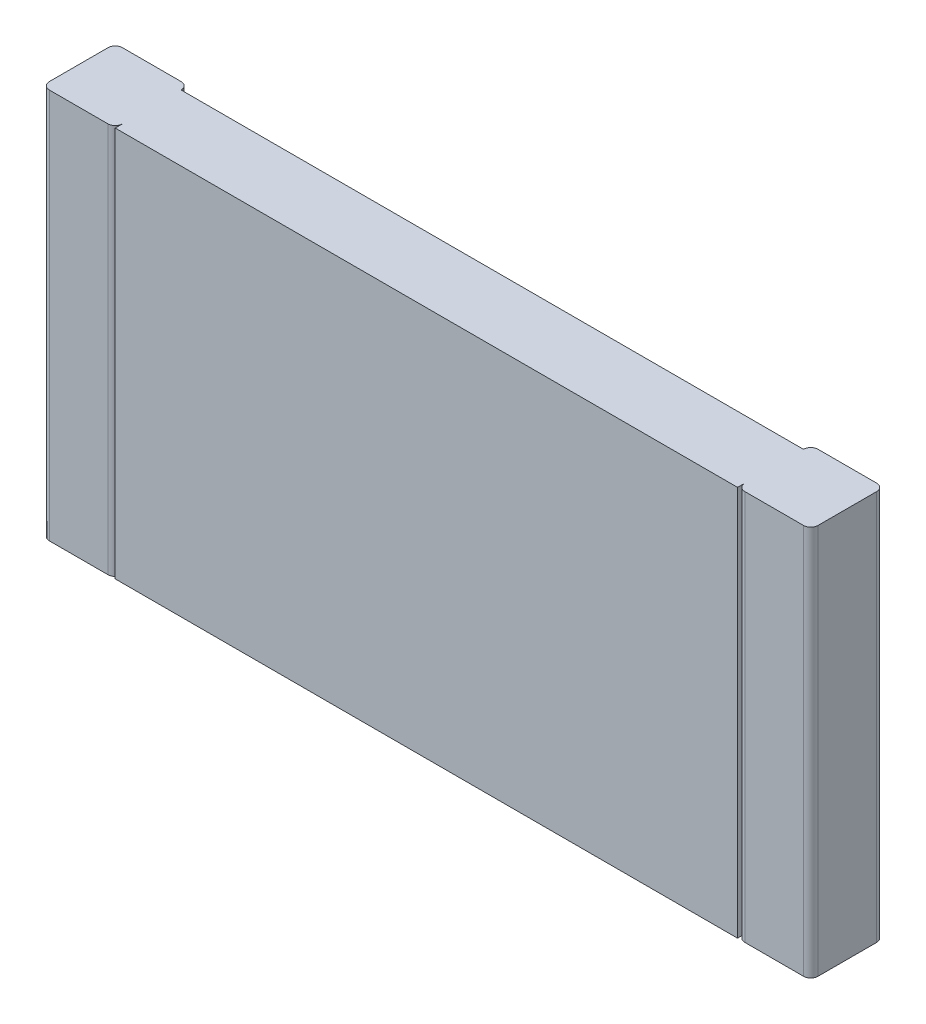
ISO-10303-21;
HEADER;
FILE_DESCRIPTION(('STEP AP214'),'2;1');
FILE_NAME('part.step','',(''),(''),'','','');
FILE_SCHEMA(('AUTOMOTIVE_DESIGN { 1 0 10303 214 1 1 1 1 }'));
ENDSEC;
DATA;
#1=APPLICATION_CONTEXT('core data for automotive mechanical design processes');
#2=APPLICATION_PROTOCOL_DEFINITION('international standard','automotive_design',2000,#1);
#3=PRODUCT_CONTEXT('',#1,'mechanical');
#4=PRODUCT('Part','Part','',(#3));
#5=PRODUCT_RELATED_PRODUCT_CATEGORY('part','',(#4));
#6=PRODUCT_DEFINITION_FORMATION('','',#4);
#7=PRODUCT_DEFINITION_CONTEXT('part definition',#1,'design');
#8=PRODUCT_DEFINITION('design','',#6,#7);
#9=PRODUCT_DEFINITION_SHAPE('','',#8);
#10=(LENGTH_UNIT() NAMED_UNIT(*) SI_UNIT(.MILLI.,.METRE.));
#11=(NAMED_UNIT(*) PLANE_ANGLE_UNIT() SI_UNIT($,.RADIAN.));
#12=(NAMED_UNIT(*) SI_UNIT($,.STERADIAN.) SOLID_ANGLE_UNIT());
#13=UNCERTAINTY_MEASURE_WITH_UNIT(LENGTH_MEASURE(1.E-05),#10,'distance_accuracy_value','');
#14=(GEOMETRIC_REPRESENTATION_CONTEXT(3) GLOBAL_UNCERTAINTY_ASSIGNED_CONTEXT((#13)) GLOBAL_UNIT_ASSIGNED_CONTEXT((#10,
#11,#12)) REPRESENTATION_CONTEXT('',''));
#15=CARTESIAN_POINT('',(0.,0.,0.));
#16=DIRECTION('',(0.,0.,1.));
#17=DIRECTION('',(1.,0.,0.));
#18=AXIS2_PLACEMENT_3D('',#15,#16,#17);
#19=CARTESIAN_POINT('',(-3.09,-1.6,0.06));
#20=DIRECTION('',(0.,1.,0.));
#21=DIRECTION('',(0.,0.,1.));
#22=AXIS2_PLACEMENT_3D('',#19,#20,#21);
#23=CYLINDRICAL_SURFACE('',#22,0.06);
#24=DIRECTION('',(0.,1.,0.));
#25=VECTOR('',#24,1.);
#26=CARTESIAN_POINT('',(-3.09,-1.6,0.));
#27=LINE('',#26,#25);
#28=CARTESIAN_POINT('',(-3.09,1.6,0.));
#29=VERTEX_POINT('',#28);
#30=CARTESIAN_POINT('',(-3.09,-1.6,0.));
#31=VERTEX_POINT('',#30);
#32=EDGE_CURVE('E177',#29,#31,#27,.F.);
#33=ORIENTED_EDGE('',*,*,#32,.T.);
#34=CARTESIAN_POINT('',(-3.09,-1.6,0.06));
#35=DIRECTION('',(0.,1.,0.));
#36=DIRECTION('',(0.,0.,1.));
#37=AXIS2_PLACEMENT_3D('',#34,#35,#36);
#38=CIRCLE('',#37,0.06);
#39=CARTESIAN_POINT('',(-3.15,-1.6,0.06));
#40=VERTEX_POINT('',#39);
#41=EDGE_CURVE('E150',#31,#40,#38,.T.);
#42=ORIENTED_EDGE('',*,*,#41,.T.);
#43=DIRECTION('',(0.,1.,0.));
#44=VECTOR('',#43,1.);
#45=CARTESIAN_POINT('',(-3.15,-1.6,0.06));
#46=LINE('',#45,#44);
#47=CARTESIAN_POINT('',(-3.15,1.6,0.06));
#48=VERTEX_POINT('',#47);
#49=EDGE_CURVE('E153',#40,#48,#46,.T.);
#50=ORIENTED_EDGE('',*,*,#49,.T.);
#51=CARTESIAN_POINT('',(-3.09,1.6,0.06));
#52=DIRECTION('',(0.,1.,0.));
#53=DIRECTION('',(0.,0.,1.));
#54=AXIS2_PLACEMENT_3D('',#51,#52,#53);
#55=CIRCLE('',#54,0.06);
#56=EDGE_CURVE('E20',#48,#29,#55,.F.);
#57=ORIENTED_EDGE('',*,*,#56,.T.);
#58=EDGE_LOOP('',(#33,#42,#50,#57));
#59=FACE_BOUND('',#58,.T.);
#60=ADVANCED_FACE('F17',(#59),#23,.T.);
#61=CARTESIAN_POINT('',(3.09,-1.6,0.06));
#62=DIRECTION('',(0.,1.,0.));
#63=DIRECTION('',(0.,0.,1.));
#64=AXIS2_PLACEMENT_3D('',#61,#62,#63);
#65=CYLINDRICAL_SURFACE('',#64,0.06);
#66=CARTESIAN_POINT('',(3.09,1.6,0.06));
#67=DIRECTION('',(0.,1.,0.));
#68=DIRECTION('',(0.,0.,1.));
#69=AXIS2_PLACEMENT_3D('',#66,#67,#68);
#70=CIRCLE('',#69,0.06);
#71=CARTESIAN_POINT('',(3.09,1.6,0.));
#72=VERTEX_POINT('',#71);
#73=CARTESIAN_POINT('',(3.15,1.6,0.06));
#74=VERTEX_POINT('',#73);
#75=EDGE_CURVE('E171',#72,#74,#70,.F.);
#76=ORIENTED_EDGE('',*,*,#75,.T.);
#77=DIRECTION('',(0.,1.,0.));
#78=VECTOR('',#77,1.);
#79=CARTESIAN_POINT('',(3.15,-1.6,0.06));
#80=LINE('',#79,#78);
#81=CARTESIAN_POINT('',(3.15,-1.6,0.06));
#82=VERTEX_POINT('',#81);
#83=EDGE_CURVE('E165',#82,#74,#80,.T.);
#84=ORIENTED_EDGE('',*,*,#83,.F.);
#85=CARTESIAN_POINT('',(3.09,-1.6,0.06));
#86=DIRECTION('',(0.,1.,0.));
#87=DIRECTION('',(0.,0.,1.));
#88=AXIS2_PLACEMENT_3D('',#85,#86,#87);
#89=CIRCLE('',#88,0.06);
#90=CARTESIAN_POINT('',(3.09,-1.6,0.));
#91=VERTEX_POINT('',#90);
#92=EDGE_CURVE('E223',#82,#91,#89,.T.);
#93=ORIENTED_EDGE('',*,*,#92,.T.);
#94=DIRECTION('',(0.,1.,0.));
#95=VECTOR('',#94,1.);
#96=CARTESIAN_POINT('',(3.09,-1.6,0.));
#97=LINE('',#96,#95);
#98=EDGE_CURVE('E172',#91,#72,#97,.T.);
#99=ORIENTED_EDGE('',*,*,#98,.T.);
#100=EDGE_LOOP('',(#76,#84,#93,#99));
#101=FACE_BOUND('',#100,.T.);
#102=ADVANCED_FACE('F228',(#101),#65,.T.);
#103=CARTESIAN_POINT('',(-3.15,-1.6,0.));
#104=DIRECTION('',(1.,0.,0.));
#105=DIRECTION('',(0.,0.,-1.));
#106=AXIS2_PLACEMENT_3D('',#103,#104,#105);
#107=PLANE('',#106);
#108=DIRECTION('',(0.,0.,-1.));
#109=VECTOR('',#108,1.);
#110=CARTESIAN_POINT('',(-3.15,1.6,0.));
#111=LINE('',#110,#109);
#112=CARTESIAN_POINT('',(-3.15,1.6,0.54));
#113=VERTEX_POINT('',#112);
#114=EDGE_CURVE('E143',#48,#113,#111,.F.);
#115=ORIENTED_EDGE('',*,*,#114,.F.);
#116=ORIENTED_EDGE('',*,*,#49,.F.);
#117=DIRECTION('',(0.,0.,-1.));
#118=VECTOR('',#117,1.);
#119=CARTESIAN_POINT('',(-3.15,-1.6,0.));
#120=LINE('',#119,#118);
#121=CARTESIAN_POINT('',(-3.15,-1.6,0.54));
#122=VERTEX_POINT('',#121);
#123=EDGE_CURVE('E156',#122,#40,#120,.T.);
#124=ORIENTED_EDGE('',*,*,#123,.F.);
#125=DIRECTION('',(0.,1.,0.));
#126=VECTOR('',#125,1.);
#127=CARTESIAN_POINT('',(-3.15,-1.6,0.54));
#128=LINE('',#127,#126);
#129=EDGE_CURVE('E160',#113,#122,#128,.F.);
#130=ORIENTED_EDGE('',*,*,#129,.F.);
#131=EDGE_LOOP('',(#115,#116,#124,#130));
#132=FACE_BOUND('',#131,.T.);
#133=ADVANCED_FACE('F158',(#132),#107,.F.);
#134=CARTESIAN_POINT('',(3.15,-1.6,0.));
#135=DIRECTION('',(1.,0.,0.));
#136=DIRECTION('',(0.,0.,-1.));
#137=AXIS2_PLACEMENT_3D('',#134,#135,#136);
#138=PLANE('',#137);
#139=DIRECTION('',(0.,0.,-1.));
#140=VECTOR('',#139,1.);
#141=CARTESIAN_POINT('',(3.15,1.6,0.));
#142=LINE('',#141,#140);
#143=CARTESIAN_POINT('',(3.15,1.6,0.54));
#144=VERTEX_POINT('',#143);
#145=EDGE_CURVE('E181',#74,#144,#142,.F.);
#146=ORIENTED_EDGE('',*,*,#145,.T.);
#147=DIRECTION('',(0.,1.,0.));
#148=VECTOR('',#147,1.);
#149=CARTESIAN_POINT('',(3.15,-1.6,0.54));
#150=LINE('',#149,#148);
#151=CARTESIAN_POINT('',(3.15,-1.6,0.54));
#152=VERTEX_POINT('',#151);
#153=EDGE_CURVE('E218',#152,#144,#150,.T.);
#154=ORIENTED_EDGE('',*,*,#153,.F.);
#155=DIRECTION('',(0.,0.,-1.));
#156=VECTOR('',#155,1.);
#157=CARTESIAN_POINT('',(3.15,-1.6,0.));
#158=LINE('',#157,#156);
#159=EDGE_CURVE('E162',#152,#82,#158,.T.);
#160=ORIENTED_EDGE('',*,*,#159,.T.);
#161=ORIENTED_EDGE('',*,*,#83,.T.);
#162=EDGE_LOOP('',(#146,#154,#160,#161));
#163=FACE_BOUND('',#162,.T.);
#164=ADVANCED_FACE('F248',(#163),#138,.T.);
#165=CARTESIAN_POINT('',(-3.15,-1.6,0.));
#166=DIRECTION('',(0.,0.,1.));
#167=DIRECTION('',(1.,0.,0.));
#168=AXIS2_PLACEMENT_3D('',#165,#166,#167);
#169=PLANE('',#168);
#170=DIRECTION('',(1.,0.,0.));
#171=VECTOR('',#170,1.);
#172=CARTESIAN_POINT('',(-3.15,-1.6,0.));
#173=LINE('',#172,#171);
#174=CARTESIAN_POINT('',(-2.61,-1.6,0.));
#175=VERTEX_POINT('',#174);
#176=EDGE_CURVE('E179',#31,#175,#173,.T.);
#177=ORIENTED_EDGE('',*,*,#176,.F.);
#178=ORIENTED_EDGE('',*,*,#32,.F.);
#179=DIRECTION('',(1.,0.,0.));
#180=VECTOR('',#179,1.);
#181=CARTESIAN_POINT('',(-3.15,1.6,0.));
#182=LINE('',#181,#180);
#183=CARTESIAN_POINT('',(-2.61,1.6,0.));
#184=VERTEX_POINT('',#183);
#185=EDGE_CURVE('E146',#184,#29,#182,.F.);
#186=ORIENTED_EDGE('',*,*,#185,.F.);
#187=DIRECTION('',(0.,1.,0.));
#188=VECTOR('',#187,1.);
#189=CARTESIAN_POINT('',(-2.61,-1.6,0.));
#190=LINE('',#189,#188);
#191=EDGE_CURVE('E217',#175,#184,#190,.T.);
#192=ORIENTED_EDGE('',*,*,#191,.F.);
#193=EDGE_LOOP('',(#177,#178,#186,#192));
#194=FACE_BOUND('',#193,.T.);
#195=ADVANCED_FACE('F336',(#194),#169,.F.);
#196=CARTESIAN_POINT('',(2.55,-1.6,0.));
#197=DIRECTION('',(0.,0.,1.));
#198=DIRECTION('',(1.,0.,0.));
#199=AXIS2_PLACEMENT_3D('',#196,#197,#198);
#200=PLANE('',#199);
#201=DIRECTION('',(1.,0.,0.));
#202=VECTOR('',#201,1.);
#203=CARTESIAN_POINT('',(2.55,-1.6,0.));
#204=LINE('',#203,#202);
#205=CARTESIAN_POINT('',(2.61,-1.6,0.));
#206=VERTEX_POINT('',#205);
#207=EDGE_CURVE('E176',#206,#91,#204,.T.);
#208=ORIENTED_EDGE('',*,*,#207,.F.);
#209=DIRECTION('',(0.,1.,0.));
#210=VECTOR('',#209,1.);
#211=CARTESIAN_POINT('',(2.61,-1.6,0.));
#212=LINE('',#211,#210);
#213=CARTESIAN_POINT('',(2.61,1.6,0.));
#214=VERTEX_POINT('',#213);
#215=EDGE_CURVE('E236',#214,#206,#212,.F.);
#216=ORIENTED_EDGE('',*,*,#215,.F.);
#217=DIRECTION('',(1.,0.,0.));
#218=VECTOR('',#217,1.);
#219=CARTESIAN_POINT('',(2.55,1.6,0.));
#220=LINE('',#219,#218);
#221=EDGE_CURVE('E235',#72,#214,#220,.F.);
#222=ORIENTED_EDGE('',*,*,#221,.F.);
#223=ORIENTED_EDGE('',*,*,#98,.F.);
#224=EDGE_LOOP('',(#208,#216,#222,#223));
#225=FACE_BOUND('',#224,.T.);
#226=ADVANCED_FACE('F232',(#225),#200,.F.);
#227=CARTESIAN_POINT('',(-3.09,-1.6,0.54));
#228=DIRECTION('',(0.,1.,0.));
#229=DIRECTION('',(0.,0.,1.));
#230=AXIS2_PLACEMENT_3D('',#227,#228,#229);
#231=CYLINDRICAL_SURFACE('',#230,0.06);
#232=CARTESIAN_POINT('',(-3.09,1.6,0.54));
#233=DIRECTION('',(0.,1.,0.));
#234=DIRECTION('',(0.,0.,1.));
#235=AXIS2_PLACEMENT_3D('',#232,#233,#234);
#236=CIRCLE('',#235,0.06);
#237=CARTESIAN_POINT('',(-3.09,1.6,0.6));
#238=VERTEX_POINT('',#237);
#239=EDGE_CURVE('E219',#238,#113,#236,.F.);
#240=ORIENTED_EDGE('',*,*,#239,.T.);
#241=ORIENTED_EDGE('',*,*,#129,.T.);
#242=CARTESIAN_POINT('',(-3.09,-1.6,0.54));
#243=DIRECTION('',(0.,1.,0.));
#244=DIRECTION('',(0.,0.,1.));
#245=AXIS2_PLACEMENT_3D('',#242,#243,#244);
#246=CIRCLE('',#245,0.06);
#247=CARTESIAN_POINT('',(-3.09,-1.6,0.6));
#248=VERTEX_POINT('',#247);
#249=EDGE_CURVE('E175',#122,#248,#246,.T.);
#250=ORIENTED_EDGE('',*,*,#249,.T.);
#251=DIRECTION('',(0.,1.,0.));
#252=VECTOR('',#251,1.);
#253=CARTESIAN_POINT('',(-3.09,-1.6,0.6));
#254=LINE('',#253,#252);
#255=EDGE_CURVE('E260',#238,#248,#254,.F.);
#256=ORIENTED_EDGE('',*,*,#255,.F.);
#257=EDGE_LOOP('',(#240,#241,#250,#256));
#258=FACE_BOUND('',#257,.T.);
#259=ADVANCED_FACE('F257',(#258),#231,.T.);
#260=CARTESIAN_POINT('',(3.09,-1.6,0.54));
#261=DIRECTION('',(0.,1.,0.));
#262=DIRECTION('',(0.,0.,1.));
#263=AXIS2_PLACEMENT_3D('',#260,#261,#262);
#264=CYLINDRICAL_SURFACE('',#263,0.06);
#265=DIRECTION('',(0.,1.,0.));
#266=VECTOR('',#265,1.);
#267=CARTESIAN_POINT('',(3.09,-1.6,0.6));
#268=LINE('',#267,#266);
#269=CARTESIAN_POINT('',(3.09,-1.6,0.6));
#270=VERTEX_POINT('',#269);
#271=CARTESIAN_POINT('',(3.09,1.6,0.6));
#272=VERTEX_POINT('',#271);
#273=EDGE_CURVE('E266',#270,#272,#268,.T.);
#274=ORIENTED_EDGE('',*,*,#273,.F.);
#275=CARTESIAN_POINT('',(3.09,-1.6,0.54));
#276=DIRECTION('',(0.,1.,0.));
#277=DIRECTION('',(0.,0.,1.));
#278=AXIS2_PLACEMENT_3D('',#275,#276,#277);
#279=CIRCLE('',#278,0.06);
#280=EDGE_CURVE('E205',#270,#152,#279,.T.);
#281=ORIENTED_EDGE('',*,*,#280,.T.);
#282=ORIENTED_EDGE('',*,*,#153,.T.);
#283=CARTESIAN_POINT('',(3.09,1.6,0.54));
#284=DIRECTION('',(0.,1.,0.));
#285=DIRECTION('',(0.,0.,1.));
#286=AXIS2_PLACEMENT_3D('',#283,#284,#285);
#287=CIRCLE('',#286,0.06);
#288=EDGE_CURVE('E215',#144,#272,#287,.F.);
#289=ORIENTED_EDGE('',*,*,#288,.T.);
#290=EDGE_LOOP('',(#274,#281,#282,#289));
#291=FACE_BOUND('',#290,.T.);
#292=ADVANCED_FACE('F255',(#291),#264,.T.);
#293=CARTESIAN_POINT('',(-2.61,-1.6,0.06));
#294=DIRECTION('',(0.,1.,0.));
#295=DIRECTION('',(0.,0.,1.));
#296=AXIS2_PLACEMENT_3D('',#293,#294,#295);
#297=CYLINDRICAL_SURFACE('',#296,0.06);
#298=CARTESIAN_POINT('',(-2.61,1.6,0.06));
#299=DIRECTION('',(0.,1.,0.));
#300=DIRECTION('',(0.,0.,1.));
#301=AXIS2_PLACEMENT_3D('',#298,#299,#300);
#302=CIRCLE('',#301,0.06);
#303=CARTESIAN_POINT('',(-2.55,1.6,0.06));
#304=VERTEX_POINT('',#303);
#305=EDGE_CURVE('E202',#304,#184,#302,.T.);
#306=ORIENTED_EDGE('',*,*,#305,.F.);
#307=DIRECTION('',(0.,1.,0.));
#308=VECTOR('',#307,1.);
#309=CARTESIAN_POINT('',(-2.55,-1.6,0.06));
#310=LINE('',#309,#308);
#311=CARTESIAN_POINT('',(-2.55,-1.6,0.06));
#312=VERTEX_POINT('',#311);
#313=EDGE_CURVE('E292',#304,#312,#310,.F.);
#314=ORIENTED_EDGE('',*,*,#313,.T.);
#315=CARTESIAN_POINT('',(-2.61,-1.6,0.06));
#316=DIRECTION('',(0.,1.,0.));
#317=DIRECTION('',(0.,0.,1.));
#318=AXIS2_PLACEMENT_3D('',#315,#316,#317);
#319=CIRCLE('',#318,0.06);
#320=EDGE_CURVE('E211',#312,#175,#319,.T.);
#321=ORIENTED_EDGE('',*,*,#320,.T.);
#322=ORIENTED_EDGE('',*,*,#191,.T.);
#323=EDGE_LOOP('',(#306,#314,#321,#322));
#324=FACE_BOUND('',#323,.T.);
#325=ADVANCED_FACE('F332',(#324),#297,.T.);
#326=CARTESIAN_POINT('',(2.61,-1.6,0.06));
#327=DIRECTION('',(0.,1.,0.));
#328=DIRECTION('',(0.,0.,1.));
#329=AXIS2_PLACEMENT_3D('',#326,#327,#328);
#330=CYLINDRICAL_SURFACE('',#329,0.06);
#331=ORIENTED_EDGE('',*,*,#215,.T.);
#332=CARTESIAN_POINT('',(2.61,-1.6,0.06));
#333=DIRECTION('',(0.,1.,0.));
#334=DIRECTION('',(0.,0.,1.));
#335=AXIS2_PLACEMENT_3D('',#332,#333,#334);
#336=CIRCLE('',#335,0.06);
#337=CARTESIAN_POINT('',(2.55,-1.6,0.06));
#338=VERTEX_POINT('',#337);
#339=EDGE_CURVE('E209',#206,#338,#336,.T.);
#340=ORIENTED_EDGE('',*,*,#339,.T.);
#341=DIRECTION('',(0.,1.,0.));
#342=VECTOR('',#341,1.);
#343=CARTESIAN_POINT('',(2.55,-1.6,0.06));
#344=LINE('',#343,#342);
#345=CARTESIAN_POINT('',(2.55,1.6,0.06));
#346=VERTEX_POINT('',#345);
#347=EDGE_CURVE('E197',#338,#346,#344,.T.);
#348=ORIENTED_EDGE('',*,*,#347,.T.);
#349=CARTESIAN_POINT('',(2.61,1.6,0.06));
#350=DIRECTION('',(0.,1.,0.));
#351=DIRECTION('',(0.,0.,1.));
#352=AXIS2_PLACEMENT_3D('',#349,#350,#351);
#353=CIRCLE('',#352,0.06);
#354=EDGE_CURVE('E198',#214,#346,#353,.T.);
#355=ORIENTED_EDGE('',*,*,#354,.F.);
#356=EDGE_LOOP('',(#331,#340,#348,#355));
#357=FACE_BOUND('',#356,.T.);
#358=ADVANCED_FACE('F323',(#357),#330,.T.);
#359=CARTESIAN_POINT('',(-3.15,-1.6,0.6));
#360=DIRECTION('',(0.,0.,1.));
#361=DIRECTION('',(1.,0.,0.));
#362=AXIS2_PLACEMENT_3D('',#359,#360,#361);
#363=PLANE('',#362);
#364=DIRECTION('',(1.,0.,0.));
#365=VECTOR('',#364,1.);
#366=CARTESIAN_POINT('',(-3.15,-1.6,0.6));
#367=LINE('',#366,#365);
#368=CARTESIAN_POINT('',(-2.61,-1.6,0.6));
#369=VERTEX_POINT('',#368);
#370=EDGE_CURVE('E214',#248,#369,#367,.T.);
#371=ORIENTED_EDGE('',*,*,#370,.T.);
#372=DIRECTION('',(0.,1.,0.));
#373=VECTOR('',#372,1.);
#374=CARTESIAN_POINT('',(-2.61,-1.6,0.6));
#375=LINE('',#374,#373);
#376=CARTESIAN_POINT('',(-2.61,1.6,0.6));
#377=VERTEX_POINT('',#376);
#378=EDGE_CURVE('E193',#377,#369,#375,.F.);
#379=ORIENTED_EDGE('',*,*,#378,.F.);
#380=DIRECTION('',(1.,0.,0.));
#381=VECTOR('',#380,1.);
#382=CARTESIAN_POINT('',(-3.15,1.6,0.6));
#383=LINE('',#382,#381);
#384=EDGE_CURVE('E204',#238,#377,#383,.T.);
#385=ORIENTED_EDGE('',*,*,#384,.F.);
#386=ORIENTED_EDGE('',*,*,#255,.T.);
#387=EDGE_LOOP('',(#371,#379,#385,#386));
#388=FACE_BOUND('',#387,.T.);
#389=ADVANCED_FACE('F269',(#388),#363,.T.);
#390=CARTESIAN_POINT('',(2.55,-1.6,0.6));
#391=DIRECTION('',(0.,0.,1.));
#392=DIRECTION('',(1.,0.,0.));
#393=AXIS2_PLACEMENT_3D('',#390,#391,#392);
#394=PLANE('',#393);
#395=DIRECTION('',(1.,0.,0.));
#396=VECTOR('',#395,1.);
#397=CARTESIAN_POINT('',(2.55,-1.6,0.6));
#398=LINE('',#397,#396);
#399=CARTESIAN_POINT('',(2.61,-1.6,0.6));
#400=VERTEX_POINT('',#399);
#401=EDGE_CURVE('E208',#400,#270,#398,.T.);
#402=ORIENTED_EDGE('',*,*,#401,.T.);
#403=ORIENTED_EDGE('',*,*,#273,.T.);
#404=DIRECTION('',(1.,0.,0.));
#405=VECTOR('',#404,1.);
#406=CARTESIAN_POINT('',(2.55,1.6,0.6));
#407=LINE('',#406,#405);
#408=CARTESIAN_POINT('',(2.61,1.6,0.6));
#409=VERTEX_POINT('',#408);
#410=EDGE_CURVE('E201',#409,#272,#407,.T.);
#411=ORIENTED_EDGE('',*,*,#410,.F.);
#412=DIRECTION('',(0.,1.,0.));
#413=VECTOR('',#412,1.);
#414=CARTESIAN_POINT('',(2.61,-1.6,0.6));
#415=LINE('',#414,#413);
#416=EDGE_CURVE('E186',#400,#409,#415,.T.);
#417=ORIENTED_EDGE('',*,*,#416,.F.);
#418=EDGE_LOOP('',(#402,#403,#411,#417));
#419=FACE_BOUND('',#418,.T.);
#420=ADVANCED_FACE('F368',(#419),#394,.T.);
#421=CARTESIAN_POINT('',(-3.09,-1.6,0.06));
#422=DIRECTION('',(0.,0.,1.));
#423=DIRECTION('',(1.,0.,0.));
#424=AXIS2_PLACEMENT_3D('',#421,#422,#423);
#425=PLANE('',#424);
#426=ORIENTED_EDGE('',*,*,#347,.F.);
#427=DIRECTION('',(1.,0.,0.));
#428=VECTOR('',#427,1.);
#429=CARTESIAN_POINT('',(-3.09,-1.6,0.06));
#430=LINE('',#429,#428);
#431=EDGE_CURVE('E190',#338,#312,#430,.F.);
#432=ORIENTED_EDGE('',*,*,#431,.T.);
#433=ORIENTED_EDGE('',*,*,#313,.F.);
#434=DIRECTION('',(1.,0.,0.));
#435=VECTOR('',#434,1.);
#436=CARTESIAN_POINT('',(-3.09,1.6,0.06));
#437=LINE('',#436,#435);
#438=EDGE_CURVE('E185',#346,#304,#437,.F.);
#439=ORIENTED_EDGE('',*,*,#438,.F.);
#440=EDGE_LOOP('',(#426,#432,#433,#439));
#441=FACE_BOUND('',#440,.T.);
#442=ADVANCED_FACE('F329',(#441),#425,.F.);
#443=CARTESIAN_POINT('',(-2.61,-1.6,0.54));
#444=DIRECTION('',(0.,1.,0.));
#445=DIRECTION('',(0.,0.,1.));
#446=AXIS2_PLACEMENT_3D('',#443,#444,#445);
#447=CYLINDRICAL_SURFACE('',#446,0.06);
#448=ORIENTED_EDGE('',*,*,#378,.T.);
#449=CARTESIAN_POINT('',(-2.61,-1.6,0.54));
#450=DIRECTION('',(0.,1.,0.));
#451=DIRECTION('',(0.,0.,1.));
#452=AXIS2_PLACEMENT_3D('',#449,#450,#451);
#453=CIRCLE('',#452,0.06);
#454=CARTESIAN_POINT('',(-2.55,-1.6,0.54));
#455=VERTEX_POINT('',#454);
#456=EDGE_CURVE('E191',#369,#455,#453,.T.);
#457=ORIENTED_EDGE('',*,*,#456,.T.);
#458=DIRECTION('',(0.,1.,0.));
#459=VECTOR('',#458,1.);
#460=CARTESIAN_POINT('',(-2.55,-1.6,0.54));
#461=LINE('',#460,#459);
#462=CARTESIAN_POINT('',(-2.55,1.6,0.54));
#463=VERTEX_POINT('',#462);
#464=EDGE_CURVE('E276',#455,#463,#461,.T.);
#465=ORIENTED_EDGE('',*,*,#464,.T.);
#466=CARTESIAN_POINT('',(-2.61,1.6,0.54));
#467=DIRECTION('',(0.,1.,0.));
#468=DIRECTION('',(0.,0.,1.));
#469=AXIS2_PLACEMENT_3D('',#466,#467,#468);
#470=CIRCLE('',#469,0.06);
#471=EDGE_CURVE('E194',#463,#377,#470,.F.);
#472=ORIENTED_EDGE('',*,*,#471,.T.);
#473=EDGE_LOOP('',(#448,#457,#465,#472));
#474=FACE_BOUND('',#473,.T.);
#475=ADVANCED_FACE('F274',(#474),#447,.T.);
#476=CARTESIAN_POINT('',(2.61,-1.6,0.54));
#477=DIRECTION('',(0.,1.,0.));
#478=DIRECTION('',(0.,0.,1.));
#479=AXIS2_PLACEMENT_3D('',#476,#477,#478);
#480=CYLINDRICAL_SURFACE('',#479,0.06);
#481=CARTESIAN_POINT('',(2.61,1.6,0.54));
#482=DIRECTION('',(0.,1.,0.));
#483=DIRECTION('',(0.,0.,1.));
#484=AXIS2_PLACEMENT_3D('',#481,#482,#483);
#485=CIRCLE('',#484,0.06);
#486=CARTESIAN_POINT('',(2.55,1.6,0.54));
#487=VERTEX_POINT('',#486);
#488=EDGE_CURVE('E183',#409,#487,#485,.F.);
#489=ORIENTED_EDGE('',*,*,#488,.T.);
#490=DIRECTION('',(0.,1.,0.));
#491=VECTOR('',#490,1.);
#492=CARTESIAN_POINT('',(2.55,-1.6,0.54));
#493=LINE('',#492,#491);
#494=CARTESIAN_POINT('',(2.55,-1.6,0.54));
#495=VERTEX_POINT('',#494);
#496=EDGE_CURVE('E286',#495,#487,#493,.T.);
#497=ORIENTED_EDGE('',*,*,#496,.F.);
#498=CARTESIAN_POINT('',(2.61,-1.6,0.54));
#499=DIRECTION('',(0.,1.,0.));
#500=DIRECTION('',(0.,0.,1.));
#501=AXIS2_PLACEMENT_3D('',#498,#499,#500);
#502=CIRCLE('',#501,0.06);
#503=EDGE_CURVE('E187',#495,#400,#502,.T.);
#504=ORIENTED_EDGE('',*,*,#503,.T.);
#505=ORIENTED_EDGE('',*,*,#416,.T.);
#506=EDGE_LOOP('',(#489,#497,#504,#505));
#507=FACE_BOUND('',#506,.T.);
#508=ADVANCED_FACE('F360',(#507),#480,.T.);
#509=CARTESIAN_POINT('',(-2.55,-1.6,0.54));
#510=DIRECTION('',(1.,0.,0.));
#511=DIRECTION('',(0.,0.,-1.));
#512=AXIS2_PLACEMENT_3D('',#509,#510,#511);
#513=PLANE('',#512);
#514=DIRECTION('',(0.,0.,1.));
#515=VECTOR('',#514,1.);
#516=CARTESIAN_POINT('',(-2.55,1.6,0.54));
#517=LINE('',#516,#515);
#518=CARTESIAN_POINT('',(-2.55,1.6,0.6));
#519=VERTEX_POINT('',#518);
#520=EDGE_CURVE('E282',#463,#519,#517,.T.);
#521=ORIENTED_EDGE('',*,*,#520,.F.);
#522=ORIENTED_EDGE('',*,*,#464,.F.);
#523=DIRECTION('',(0.,0.,1.));
#524=VECTOR('',#523,1.);
#525=CARTESIAN_POINT('',(-2.55,-1.6,0.54));
#526=LINE('',#525,#524);
#527=CARTESIAN_POINT('',(-2.55,-1.6,0.6));
#528=VERTEX_POINT('',#527);
#529=EDGE_CURVE('E280',#455,#528,#526,.T.);
#530=ORIENTED_EDGE('',*,*,#529,.T.);
#531=DIRECTION('',(0.,1.,0.));
#532=VECTOR('',#531,1.);
#533=CARTESIAN_POINT('',(-2.55,-1.6,0.6));
#534=LINE('',#533,#532);
#535=EDGE_CURVE('E285',#519,#528,#534,.F.);
#536=ORIENTED_EDGE('',*,*,#535,.F.);
#537=EDGE_LOOP('',(#521,#522,#530,#536));
#538=FACE_BOUND('',#537,.T.);
#539=ADVANCED_FACE('F283',(#538),#513,.F.);
#540=CARTESIAN_POINT('',(-2.55,-1.6,0.54));
#541=DIRECTION('',(0.,1.,0.));
#542=DIRECTION('',(0.,0.,1.));
#543=AXIS2_PLACEMENT_3D('',#540,#541,#542);
#544=PLANE('',#543);
#545=DIRECTION('',(1.,0.,0.));
#546=VECTOR('',#545,1.);
#547=CARTESIAN_POINT('',(-2.55,-1.6,0.6));
#548=LINE('',#547,#546);
#549=CARTESIAN_POINT('',(2.55,-1.6,0.6));
#550=VERTEX_POINT('',#549);
#551=EDGE_CURVE('E310',#528,#550,#548,.T.);
#552=ORIENTED_EDGE('',*,*,#551,.F.);
#553=ORIENTED_EDGE('',*,*,#529,.F.);
#554=ORIENTED_EDGE('',*,*,#456,.F.);
#555=ORIENTED_EDGE('',*,*,#370,.F.);
#556=ORIENTED_EDGE('',*,*,#249,.F.);
#557=ORIENTED_EDGE('',*,*,#123,.T.);
#558=ORIENTED_EDGE('',*,*,#41,.F.);
#559=ORIENTED_EDGE('',*,*,#176,.T.);
#560=ORIENTED_EDGE('',*,*,#320,.F.);
#561=ORIENTED_EDGE('',*,*,#431,.F.);
#562=ORIENTED_EDGE('',*,*,#339,.F.);
#563=ORIENTED_EDGE('',*,*,#207,.T.);
#564=ORIENTED_EDGE('',*,*,#92,.F.);
#565=ORIENTED_EDGE('',*,*,#159,.F.);
#566=ORIENTED_EDGE('',*,*,#280,.F.);
#567=ORIENTED_EDGE('',*,*,#401,.F.);
#568=ORIENTED_EDGE('',*,*,#503,.F.);
#569=DIRECTION('',(0.,0.,-1.));
#570=VECTOR('',#569,1.);
#571=CARTESIAN_POINT('',(2.55,-1.6,0.54));
#572=LINE('',#571,#570);
#573=EDGE_CURVE('E289',#550,#495,#572,.T.);
#574=ORIENTED_EDGE('',*,*,#573,.F.);
#575=EDGE_LOOP('',(#552,#553,#554,#555,#556,#557,#558,#559,#560,#561,#562,#563,#564,#565,#566,
#567,#568,#574));
#576=FACE_BOUND('',#575,.T.);
#577=ADVANCED_FACE('F308',(#576),#544,.F.);
#578=CARTESIAN_POINT('',(2.55,-1.6,0.54));
#579=DIRECTION('',(1.,0.,0.));
#580=DIRECTION('',(0.,0.,-1.));
#581=AXIS2_PLACEMENT_3D('',#578,#579,#580);
#582=PLANE('',#581);
#583=DIRECTION('',(0.,0.,1.));
#584=VECTOR('',#583,1.);
#585=CARTESIAN_POINT('',(2.55,1.6,0.54));
#586=LINE('',#585,#584);
#587=CARTESIAN_POINT('',(2.55,1.6,0.6));
#588=VERTEX_POINT('',#587);
#589=EDGE_CURVE('E35',#588,#487,#586,.F.);
#590=ORIENTED_EDGE('',*,*,#589,.F.);
#591=DIRECTION('',(0.,1.,0.));
#592=VECTOR('',#591,1.);
#593=CARTESIAN_POINT('',(2.55,-1.6,0.6));
#594=LINE('',#593,#592);
#595=EDGE_CURVE('E26',#550,#588,#594,.T.);
#596=ORIENTED_EDGE('',*,*,#595,.F.);
#597=ORIENTED_EDGE('',*,*,#573,.T.);
#598=ORIENTED_EDGE('',*,*,#496,.T.);
#599=EDGE_LOOP('',(#590,#596,#597,#598));
#600=FACE_BOUND('',#599,.T.);
#601=ADVANCED_FACE('F351',(#600),#582,.T.);
#602=CARTESIAN_POINT('',(-2.55,1.6,0.54));
#603=DIRECTION('',(0.,1.,0.));
#604=DIRECTION('',(0.,0.,1.));
#605=AXIS2_PLACEMENT_3D('',#602,#603,#604);
#606=PLANE('',#605);
#607=DIRECTION('',(1.,0.,0.));
#608=VECTOR('',#607,1.);
#609=CARTESIAN_POINT('',(-2.55,1.6,0.6));
#610=LINE('',#609,#608);
#611=EDGE_CURVE('E11',#588,#519,#610,.F.);
#612=ORIENTED_EDGE('',*,*,#611,.F.);
#613=ORIENTED_EDGE('',*,*,#589,.T.);
#614=ORIENTED_EDGE('',*,*,#488,.F.);
#615=ORIENTED_EDGE('',*,*,#410,.T.);
#616=ORIENTED_EDGE('',*,*,#288,.F.);
#617=ORIENTED_EDGE('',*,*,#145,.F.);
#618=ORIENTED_EDGE('',*,*,#75,.F.);
#619=ORIENTED_EDGE('',*,*,#221,.T.);
#620=ORIENTED_EDGE('',*,*,#354,.T.);
#621=ORIENTED_EDGE('',*,*,#438,.T.);
#622=ORIENTED_EDGE('',*,*,#305,.T.);
#623=ORIENTED_EDGE('',*,*,#185,.T.);
#624=ORIENTED_EDGE('',*,*,#56,.F.);
#625=ORIENTED_EDGE('',*,*,#114,.T.);
#626=ORIENTED_EDGE('',*,*,#239,.F.);
#627=ORIENTED_EDGE('',*,*,#384,.T.);
#628=ORIENTED_EDGE('',*,*,#471,.F.);
#629=ORIENTED_EDGE('',*,*,#520,.T.);
#630=EDGE_LOOP('',(#612,#613,#614,#615,#616,#617,#618,#619,#620,#621,#622,#623,#624,#625,#626,
#627,#628,#629));
#631=FACE_BOUND('',#630,.T.);
#632=ADVANCED_FACE('F141',(#631),#606,.T.);
#633=CARTESIAN_POINT('',(-2.55,-1.6,0.6));
#634=DIRECTION('',(0.,0.,1.));
#635=DIRECTION('',(1.,0.,0.));
#636=AXIS2_PLACEMENT_3D('',#633,#634,#635);
#637=PLANE('',#636);
#638=ORIENTED_EDGE('',*,*,#595,.T.);
#639=ORIENTED_EDGE('',*,*,#611,.T.);
#640=ORIENTED_EDGE('',*,*,#535,.T.);
#641=ORIENTED_EDGE('',*,*,#551,.T.);
#642=EDGE_LOOP('',(#638,#639,#640,#641));
#643=FACE_BOUND('',#642,.T.);
#644=ADVANCED_FACE('F314',(#643),#637,.T.);
#645=CLOSED_SHELL('',(#60,#102,#133,#164,#195,#226,#259,#292,#325,#358,#389,#420,#442,#475,#508,
#539,#577,#601,#632,#644));
#646=MANIFOLD_SOLID_BREP('B1',#645);
#647=ADVANCED_BREP_SHAPE_REPRESENTATION('',(#18,#646),#14);
#648=SHAPE_DEFINITION_REPRESENTATION(#9,#647);
ENDSEC;
END-ISO-10303-21;
